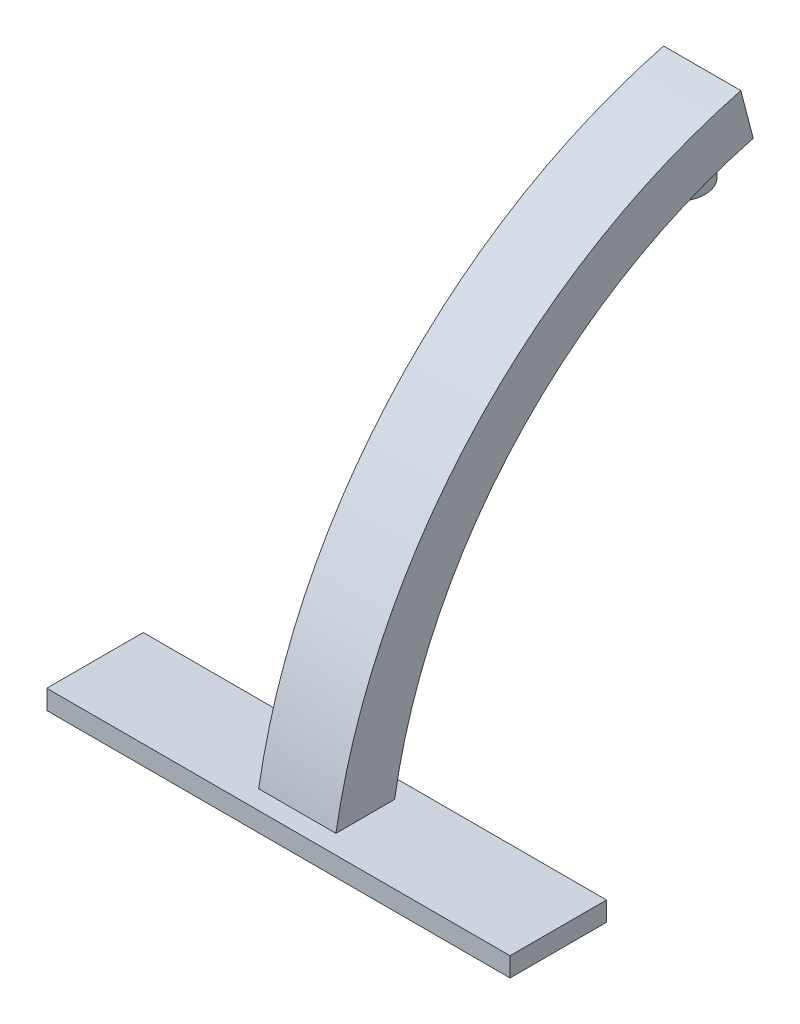
ISO-10303-21;
HEADER;
FILE_DESCRIPTION(('STEP AP214'),'2;1');
FILE_NAME('part.step','',(''),(''),'','','');
FILE_SCHEMA(('AUTOMOTIVE_DESIGN { 1 0 10303 214 1 1 1 1 }'));
ENDSEC;
DATA;
#1=APPLICATION_CONTEXT('core data for automotive mechanical design processes');
#2=APPLICATION_PROTOCOL_DEFINITION('international standard','automotive_design',2000,#1);
#3=PRODUCT_CONTEXT('',#1,'mechanical');
#4=PRODUCT('Part','Part','',(#3));
#5=PRODUCT_RELATED_PRODUCT_CATEGORY('part','',(#4));
#6=PRODUCT_DEFINITION_FORMATION('','',#4);
#7=PRODUCT_DEFINITION_CONTEXT('part definition',#1,'design');
#8=PRODUCT_DEFINITION('design','',#6,#7);
#9=PRODUCT_DEFINITION_SHAPE('','',#8);
#10=(LENGTH_UNIT() NAMED_UNIT(*) SI_UNIT(.MILLI.,.METRE.));
#11=(NAMED_UNIT(*) PLANE_ANGLE_UNIT() SI_UNIT($,.RADIAN.));
#12=(NAMED_UNIT(*) SI_UNIT($,.STERADIAN.) SOLID_ANGLE_UNIT());
#13=UNCERTAINTY_MEASURE_WITH_UNIT(LENGTH_MEASURE(1.E-05),#10,'distance_accuracy_value','');
#14=(GEOMETRIC_REPRESENTATION_CONTEXT(3) GLOBAL_UNCERTAINTY_ASSIGNED_CONTEXT((#13)) GLOBAL_UNIT_ASSIGNED_CONTEXT((#10,
#11,#12)) REPRESENTATION_CONTEXT('',''));
#15=CARTESIAN_POINT('',(0.,0.,0.));
#16=DIRECTION('',(0.,0.,1.));
#17=DIRECTION('',(1.,0.,0.));
#18=AXIS2_PLACEMENT_3D('',#15,#16,#17);
#19=CARTESIAN_POINT('',(63.5,-19.7348443641787,-184.022581395484));
#20=DIRECTION('',(1.,0.,0.));
#21=DIRECTION('',(0.,0.,-1.));
#22=AXIS2_PLACEMENT_3D('',#19,#20,#21);
#23=CYLINDRICAL_SURFACE('',#22,160.622919158415);
#24=DIRECTION('',(1.,0.,0.));
#25=VECTOR('',#24,1.);
#26=CARTESIAN_POINT('',(63.5,135.692592810273,-143.5005635243));
#27=LINE('',#26,#25);
#28=CARTESIAN_POINT('',(63.5,135.692592810273,-143.5005635243));
#29=VERTEX_POINT('',#28);
#30=CARTESIAN_POINT('',(88.9,135.692592810273,-143.5005635243));
#31=VERTEX_POINT('',#30);
#32=EDGE_CURVE('E182',#29,#31,#27,.T.);
#33=ORIENTED_EDGE('',*,*,#32,.T.);
#34=CARTESIAN_POINT('',(88.9,-19.7348443641787,-184.022581395484));
#35=DIRECTION('',(1.,0.,0.));
#36=DIRECTION('',(0.,0.,-1.));
#37=AXIS2_PLACEMENT_3D('',#34,#35,#36);
#38=CIRCLE('',#37,160.622919158415);
#39=CARTESIAN_POINT('',(88.9,6.35,-25.5318780294279));
#40=VERTEX_POINT('',#39);
#41=EDGE_CURVE('E161',#31,#40,#38,.T.);
#42=ORIENTED_EDGE('',*,*,#41,.T.);
#43=DIRECTION('',(1.,0.,0.));
#44=VECTOR('',#43,1.);
#45=CARTESIAN_POINT('',(63.5,6.35,-25.5318780294279));
#46=LINE('',#45,#44);
#47=CARTESIAN_POINT('',(63.5,6.35,-25.5318780294279));
#48=VERTEX_POINT('',#47);
#49=EDGE_CURVE('E179',#48,#40,#46,.T.);
#50=ORIENTED_EDGE('',*,*,#49,.F.);
#51=CARTESIAN_POINT('',(63.5,-19.7348443641787,-184.022581395484));
#52=DIRECTION('',(1.,0.,0.));
#53=DIRECTION('',(0.,0.,-1.));
#54=AXIS2_PLACEMENT_3D('',#51,#52,#53);
#55=CIRCLE('',#54,160.622919158415);
#56=EDGE_CURVE('E171',#29,#48,#55,.T.);
#57=ORIENTED_EDGE('',*,*,#56,.F.);
#58=EDGE_LOOP('',(#33,#42,#50,#57));
#59=FACE_BOUND('',#58,.T.);
#60=CARTESIAN_POINT('',(76.2,128.129005307118,-121.285));
#61=CARTESIAN_POINT('',(76.4526674331621,128.129004218327,-121.284997858437));
#62=CARTESIAN_POINT('',(76.7053066659111,128.13327527011,-121.295060972933));
#63=CARTESIAN_POINT('',(77.2087867459833,128.150298269242,-121.335204401861));
#64=CARTESIAN_POINT('',(77.4596270636416,128.163052618474,-121.365290385388));
#65=CARTESIAN_POINT('',(77.9578455859356,128.196884306877,-121.445207789697));
#66=CARTESIAN_POINT('',(78.205219729421,128.217970681064,-121.495060645332));
#67=CARTESIAN_POINT('',(78.694475981144,128.268176093866,-121.613990202545));
#68=CARTESIAN_POINT('',(78.9363578570135,128.297295471659,-121.683067715851));
#69=CARTESIAN_POINT('',(79.4123938383846,128.363100561254,-121.839560828303));
#70=CARTESIAN_POINT('',(79.6465650734362,128.399767974121,-121.926932085981));
#71=CARTESIAN_POINT('',(80.1062848459868,128.480249423183,-122.119277825864));
#72=CARTESIAN_POINT('',(80.3318332729169,128.52406355098,-122.224252533705));
#73=CARTESIAN_POINT('',(80.7728766294972,128.618300352775,-122.45082121919));
#74=CARTESIAN_POINT('',(80.9883747826617,128.668720887796,-122.572409818254));
#75=CARTESIAN_POINT('',(81.4082641051674,128.775635551108,-122.8312493196));
#76=CARTESIAN_POINT('',(81.6126512709096,128.832131847111,-122.96850581296));
#77=CARTESIAN_POINT('',(82.0162682936002,128.952711464573,-123.26273393123));
#78=CARTESIAN_POINT('',(82.2150527850469,129.016993775498,-123.420234835571));
#79=CARTESIAN_POINT('',(82.5985251649843,129.150777959365,-123.749658504238));
#80=CARTESIAN_POINT('',(82.7832078468659,129.220281741545,-123.921586546582));
#81=CARTESIAN_POINT('',(83.137523449482,129.363819945521,-124.278565271988));
#82=CARTESIAN_POINT('',(83.3071556649159,129.437854579368,-124.463616569306));
#83=CARTESIAN_POINT('',(83.6306072296066,129.589790510559,-124.84557720106));
#84=CARTESIAN_POINT('',(83.7844255845319,129.667692050587,-125.042487279909));
#85=CARTESIAN_POINT('',(84.0863766272739,129.832604506867,-125.461887737825));
#86=CARTESIAN_POINT('',(84.2332442647473,129.919862757542,-125.685192528003));
#87=CARTESIAN_POINT('',(84.5072227054554,130.097276786961,-126.142379826095));
#88=CARTESIAN_POINT('',(84.6343404626589,130.187431532291,-126.376258573282));
#89=CARTESIAN_POINT('',(84.8683663786006,130.369978572967,-126.853275484549));
#90=CARTESIAN_POINT('',(84.9752620126523,130.46237221529,-127.096419275724));
#91=CARTESIAN_POINT('',(85.1682103710966,130.648594728152,-127.59020580503));
#92=CARTESIAN_POINT('',(85.2542692918783,130.742423163168,-127.840846288835));
#93=CARTESIAN_POINT('',(85.4094726080765,130.936242904087,-128.362654872446));
#94=CARTESIAN_POINT('',(85.4773698734093,131.036280067563,-128.634177689258));
#95=CARTESIAN_POINT('',(85.5890242547924,131.23644394287,-129.182109617758));
#96=CARTESIAN_POINT('',(85.6327810012452,131.33657065605,-129.45851880419));
#97=CARTESIAN_POINT('',(85.6958351654858,131.53618691686,-130.014392465271));
#98=CARTESIAN_POINT('',(85.7151288436058,131.635676364758,-130.293857400466));
#99=CARTESIAN_POINT('',(85.7290163162777,131.833289363583,-130.853876647583));
#100=CARTESIAN_POINT('',(85.7236106777387,131.931412945807,-131.134430934355));
#101=CARTESIAN_POINT('',(85.6877064297387,132.127107364533,-131.698969329721));
#102=CARTESIAN_POINT('',(85.656824744036,132.22464671446,-131.982940152866));
#103=CARTESIAN_POINT('',(85.5694927339631,132.416907417102,-132.547776293219));
#104=CARTESIAN_POINT('',(85.513051756479,132.511629786489,-132.828642707263));
#105=CARTESIAN_POINT('',(85.3747455931772,132.697661800482,-133.385249886791));
#106=CARTESIAN_POINT('',(85.2928771088109,132.788971000598,-133.660989982351));
#107=CARTESIAN_POINT('',(85.1040398681648,132.967550529885,-134.205087132469));
#108=CARTESIAN_POINT('',(84.9970718864079,133.054820983585,-134.473444414562));
#109=CARTESIAN_POINT('',(84.7617173455658,133.222492418139,-134.993529219823));
#110=CARTESIAN_POINT('',(84.6339745089209,133.303014238044,-135.245509067221));
#111=CARTESIAN_POINT('',(84.3558626236141,133.45918740059,-135.738240391021));
#112=CARTESIAN_POINT('',(84.2054945885671,133.534838961203,-135.978992369801));
#113=CARTESIAN_POINT('',(83.8830349714884,133.680799709687,-136.447142010763));
#114=CARTESIAN_POINT('',(83.710947344429,133.751109866461,-136.674542093206));
#115=CARTESIAN_POINT('',(83.346126386386,133.885978372153,-137.113970126875));
#116=CARTESIAN_POINT('',(83.1533939135791,133.950536959951,-137.325998716458));
#117=CARTESIAN_POINT('',(82.7581435698814,134.070624880157,-137.723112811536));
#118=CARTESIAN_POINT('',(82.5565129813834,134.126436149543,-137.908996677753));
#119=CARTESIAN_POINT('',(82.1370592307786,134.232192467436,-138.263342730923));
#120=CARTESIAN_POINT('',(81.9192369087525,134.282137819939,-138.431805820641));
#121=CARTESIAN_POINT('',(81.4689686798928,134.375894542133,-138.749744164661));
#122=CARTESIAN_POINT('',(81.2365256046255,134.419707094278,-138.899223078757));
#123=CARTESIAN_POINT('',(80.7586883357763,134.500984429275,-139.177823115454));
#124=CARTESIAN_POINT('',(80.5132945417757,134.538449407824,-139.306944865666));
#125=CARTESIAN_POINT('',(80.0224704029672,134.605339223168,-139.538384647507));
#126=CARTESIAN_POINT('',(79.7775158370633,134.63504509392,-139.641631411694));
#127=CARTESIAN_POINT('',(79.279253463414,134.688348210856,-139.827456029434));
#128=CARTESIAN_POINT('',(79.0259461341545,134.711945806268,-139.910035064613));
#129=CARTESIAN_POINT('',(78.5128677431104,134.752925873254,-140.053767483815));
#130=CARTESIAN_POINT('',(78.2530975268503,134.770309153306,-140.114923654918));
#131=CARTESIAN_POINT('',(77.7290075523824,134.79878821032,-140.215261357567));
#132=CARTESIAN_POINT('',(77.4646878559017,134.80988407252,-140.254443187019));
#133=CARTESIAN_POINT('',(76.940825831002,134.825521655933,-140.309697561729));
#134=CARTESIAN_POINT('',(76.6813524490273,134.830235487706,-140.326376907956));
#135=CARTESIAN_POINT('',(76.1618744819274,134.833652692078,-140.338466223133));
#136=CARTESIAN_POINT('',(75.9018699084007,134.83235619454,-140.333876651626));
#137=CARTESIAN_POINT('',(75.3832235762999,134.823758528178,-140.303470257507));
#138=CARTESIAN_POINT('',(75.1245817270665,134.816457764014,-140.27765486542));
#139=CARTESIAN_POINT('',(74.6105041506608,134.795882118476,-140.205026087215));
#140=CARTESIAN_POINT('',(74.3550684267821,134.782607230964,-140.158212679528));
#141=CARTESIAN_POINT('',(73.8510922477064,134.750258133595,-140.044419408911));
#142=CARTESIAN_POINT('',(73.6025148641795,134.731227356458,-139.977590613454));
#143=CARTESIAN_POINT('',(73.1120429827557,134.687412413603,-139.824220284368));
#144=CARTESIAN_POINT('',(72.8701484264563,134.662628298182,-139.737678923072));
#145=CARTESIAN_POINT('',(72.3946855527883,134.607409990353,-139.545613687775));
#146=CARTESIAN_POINT('',(72.1611172831832,134.576975765539,-139.440089704902));
#147=CARTESIAN_POINT('',(71.7038577278601,134.510586195278,-139.210936348685));
#148=CARTESIAN_POINT('',(71.4801665598806,134.47463078404,-139.087306759592));
#149=CARTESIAN_POINT('',(71.0413566069085,134.396866698838,-138.821284516182));
#150=CARTESIAN_POINT('',(70.8263812669649,134.354990009965,-138.678675162992));
#151=CARTESIAN_POINT('',(70.4094081609178,134.265922361546,-138.377091818323));
#152=CARTESIAN_POINT('',(70.2074104526029,134.218731378338,-138.218117753983));
#153=CARTESIAN_POINT('',(69.8176133085327,134.119247412793,-137.885060871192));
#154=CARTESIAN_POINT('',(69.6298146808272,134.066954140478,-137.710977194083));
#155=CARTESIAN_POINT('',(69.2695089042764,133.957507545723,-137.349046479293));
#156=CARTESIAN_POINT('',(69.0970026336402,133.900353944532,-137.161198652294));
#157=CARTESIAN_POINT('',(68.7631767371143,133.779626961616,-136.767179676682));
#158=CARTESIAN_POINT('',(68.6023643394879,133.715910197487,-136.560622669442));
#159=CARTESIAN_POINT('',(68.2988744759841,133.583921695464,-136.135969845638));
#160=CARTESIAN_POINT('',(68.156197314107,133.515649881242,-135.917873835733));
#161=CARTESIAN_POINT('',(67.8896768558456,133.374891611282,-135.471725354533));
#162=CARTESIAN_POINT('',(67.7658359883727,133.302404613665,-135.243671604074));
#163=CARTESIAN_POINT('',(67.5375721854858,133.153597570854,-134.779247408436));
#164=CARTESIAN_POINT('',(67.4331499968886,133.077277378384,-134.542876643812));
#165=CARTESIAN_POINT('',(67.240003092932,132.917777028585,-134.052904760881));
#166=CARTESIAN_POINT('',(67.1521684378323,132.834442805783,-133.799002723352));
#167=CARTESIAN_POINT('',(66.9984622526262,132.664514314559,-133.285704021232));
#168=CARTESIAN_POINT('',(66.9325913028442,132.577919960066,-133.026307211651));
#169=CARTESIAN_POINT('',(66.8230095301855,132.401977411557,-132.503792493736));
#170=CARTESIAN_POINT('',(66.7792991185511,132.312629166468,-132.240674516441));
#171=CARTESIAN_POINT('',(66.7141039375747,132.131682011804,-131.712368992373));
#172=CARTESIAN_POINT('',(66.6926270708095,132.040082313819,-131.447180743473));
#173=CARTESIAN_POINT('',(66.6714308541936,131.851077784718,-130.904632248787));
#174=CARTESIAN_POINT('',(66.6727284391902,131.753596636041,-130.627258497568));
#175=CARTESIAN_POINT('',(66.699439722182,131.557446172585,-130.073983898106));
#176=CARTESIAN_POINT('',(66.7248626462797,131.458776417509,-129.798083653961));
#177=CARTESIAN_POINT('',(66.7995837087774,131.261001308332,-129.249762656209));
#178=CARTESIAN_POINT('',(66.8488766199743,131.161896054306,-128.977341154204));
#179=CARTESIAN_POINT('',(66.9710267206245,130.963910882723,-128.437601397186));
#180=CARTESIAN_POINT('',(67.043894836892,130.865031091107,-128.170285569553));
#181=CARTESIAN_POINT('',(67.2149608725505,130.66574767338,-127.635814243632));
#182=CARTESIAN_POINT('',(67.3137673281424,130.565371139477,-127.368843110781));
#183=CARTESIAN_POINT('',(67.5351273751016,130.36661280239,-126.844322013355));
#184=CARTESIAN_POINT('',(67.6576700481188,130.268230104963,-126.586767781635));
#185=CARTESIAN_POINT('',(67.9259368650511,130.07426473406,-126.08273370893));
#186=CARTESIAN_POINT('',(68.0716722883209,129.978683449921,-125.836259331608));
#187=CARTESIAN_POINT('',(68.3854291111326,129.791354664558,-125.356541416842));
#188=CARTESIAN_POINT('',(68.5534406695782,129.699605493794,-125.123292101452));
#189=CARTESIAN_POINT('',(68.9081087534556,129.522255502647,-124.675319904834));
#190=CARTESIAN_POINT('',(69.0944377284003,129.436581677131,-124.460366761557));
#191=CARTESIAN_POINT('',(69.4867077987136,129.270855460442,-124.046976715938));
#192=CARTESIAN_POINT('',(69.6926404254457,129.19080066762,-123.848532750553));
#193=CARTESIAN_POINT('',(70.1229819990445,129.037236284387,-123.469861009551));
#194=CARTESIAN_POINT('',(70.3473950533131,128.963728156615,-123.289637303447));
#195=CARTESIAN_POINT('',(70.8131656148004,128.824263909206,-122.949286547347));
#196=CARTESIAN_POINT('',(71.0545216264166,128.758307124341,-122.789157726988));
#197=CARTESIAN_POINT('',(71.5371720429383,128.638683642727,-122.499891825979));
#198=CARTESIAN_POINT('',(71.7775636638119,128.58451146292,-122.369456812594));
#199=CARTESIAN_POINT('',(72.2700663183568,128.484413371515,-122.129199341548));
#200=CARTESIAN_POINT('',(72.5221761046381,128.438486584722,-122.01937469617));
#201=CARTESIAN_POINT('',(73.0358184798867,128.355622991958,-121.821720328348));
#202=CARTESIAN_POINT('',(73.2973345574716,128.318671238669,-121.733854028593));
#203=CARTESIAN_POINT('',(73.8279835072439,128.25424850024,-121.580949154935));
#204=CARTESIAN_POINT('',(74.0971133396293,128.226773787602,-121.515901605818));
#205=CARTESIAN_POINT('',(74.6696688799031,128.179347172065,-121.40374850732));
#206=CARTESIAN_POINT('',(74.9737064992035,128.160501104622,-121.359274998896));
#207=CARTESIAN_POINT('',(75.5851767314968,128.135331035632,-121.29990252308));
#208=CARTESIAN_POINT('',(75.8926092350814,128.129006631721,-121.285002605388));
#209=CARTESIAN_POINT('',(76.2,128.129005307118,-121.285));
#210=B_SPLINE_CURVE_WITH_KNOTS('',3,(#60,#61,#62,#63,#64,#65,#66,#67,#68,#69,#70,#71,#72,#73,
#74,#75,#76,#77,#78,#79,#80,#81,#82,#83,#84,#85,#86,#87,#88,#89,#90,#91,#92,#93,#94,#95,#96,#97,
#98,#99,#100,#101,#102,#103,#104,#105,#106,#107,#108,#109,#110,#111,#112,#113,#114,#115,#116,
#117,#118,#119,#120,#121,#122,#123,#124,#125,#126,#127,#128,#129,#130,#131,#132,#133,#134,#135,
#136,#137,#138,#139,#140,#141,#142,#143,#144,#145,#146,#147,#148,#149,#150,#151,#152,#153,#154,
#155,#156,#157,#158,#159,#160,#161,#162,#163,#164,#165,#166,#167,#168,#169,#170,#171,#172,#173,
#174,#175,#176,#177,#178,#179,#180,#181,#182,#183,#184,#185,#186,#187,#188,#189,#190,#191,#192,
#193,#194,#195,#196,#197,#198,#199,#200,#201,#202,#203,#204,#205,#206,#207,#208,#209),
.UNSPECIFIED.,.T.,.F.,(4,2,2,2,2,2,2,2,2,2,2,2,2,2,2,2,2,2,2,2,2,2,2,2,2,2,2,2,2,2,2,2,2,2,2,2,
2,2,2,2,2,2,2,2,2,2,2,2,2,2,2,2,2,2,2,2,2,2,2,2,2,2,2,2,2,2,2,2,2,2,2,2,2,2,4),(0.,
0.757718209270425,1.51565104338194,2.27440802438234,3.03319704744273,3.7901677334245,
4.54714812267271,5.30388402513469,6.06089081752726,6.84495187725205,7.62930103870753,
8.41368693723562,9.19812212564094,10.0406606862492,10.8829019118878,11.7256630886786,
12.568173337807,13.4588137080603,14.3494677138669,15.2402578574914,16.1310275554306,
17.0354410093713,17.9395239912634,18.8437243031017,19.7478967166958,20.6280747906828,
21.5082134441977,22.3881920617634,23.2681341140635,24.1066677375738,24.945157885509,
25.7834861420805,26.6217885479806,27.423240997885,28.2246476162785,29.0259499341898,
29.8272413886034,30.6064618800024,31.3856655354004,32.1648166803134,32.9439686255772,
33.7173820338097,34.4907886808889,35.2641997638729,36.0376200636993,36.8207810943461,
37.6039456121076,38.3871546651684,39.1704086672318,39.9777521669239,40.7851091983088,
41.5925702490495,42.4000623472558,43.242993531109,44.0859469851065,44.9289160815693,
45.7721846958676,46.653199451956,47.5345512648408,48.4157101608681,49.2972780495666,
50.2017347919965,51.1057764799171,52.0102591825925,52.9143436283004,53.8044834525878,
54.6942404729647,55.5841957844568,56.4740726356311,57.3094115052578,58.1446616564388,
58.9785110665499,59.812032133128,60.7338884315469,61.6557151071318),.UNSPECIFIED.);
#211=CARTESIAN_POINT('',(76.2,128.129005307118,-121.285));
#212=VERTEX_POINT('',#211);
#213=EDGE_CURVE('E153',#212,#212,#210,.T.);
#214=ORIENTED_EDGE('',*,*,#213,.T.);
#215=EDGE_LOOP('',(#214));
#216=FACE_BOUND('',#215,.T.);
#217=DIRECTION('',(1.,0.,0.));
#218=VECTOR('',#217,1.);
#219=CARTESIAN_POINT('',(63.5,38.1,-34.1731471745239));
#220=LINE('',#219,#218);
#221=CARTESIAN_POINT('',(67.31,38.1,-34.1731471745239));
#222=VERTEX_POINT('',#221);
#223=CARTESIAN_POINT('',(85.09,38.1,-34.1731471745239));
#224=VERTEX_POINT('',#223);
#225=EDGE_CURVE('E12',#222,#224,#220,.T.);
#226=ORIENTED_EDGE('',*,*,#225,.F.);
#227=CARTESIAN_POINT('',(67.31,-19.7348443641787,-184.022581395484));
#228=DIRECTION('',(1.,0.,0.));
#229=DIRECTION('',(0.,0.,-1.));
#230=AXIS2_PLACEMENT_3D('',#227,#228,#229);
#231=CIRCLE('',#230,160.622919158415);
#232=CARTESIAN_POINT('',(67.31,12.7,-26.7085545890924));
#233=VERTEX_POINT('',#232);
#234=EDGE_CURVE('E47',#233,#222,#231,.F.);
#235=ORIENTED_EDGE('',*,*,#234,.F.);
#236=DIRECTION('',(1.,0.,0.));
#237=VECTOR('',#236,1.);
#238=CARTESIAN_POINT('',(63.5,12.7,-26.7085545890924));
#239=LINE('',#238,#237);
#240=CARTESIAN_POINT('',(85.09,12.7,-26.7085545890924));
#241=VERTEX_POINT('',#240);
#242=EDGE_CURVE('E411',#241,#233,#239,.F.);
#243=ORIENTED_EDGE('',*,*,#242,.F.);
#244=CARTESIAN_POINT('',(85.09,-19.7348443641787,-184.022581395484));
#245=DIRECTION('',(-1.,0.,0.));
#246=DIRECTION('',(0.,0.,1.));
#247=AXIS2_PLACEMENT_3D('',#244,#245,#246);
#248=CIRCLE('',#247,160.622919158415);
#249=EDGE_CURVE('E216',#224,#241,#248,.F.);
#250=ORIENTED_EDGE('',*,*,#249,.F.);
#251=EDGE_LOOP('',(#226,#235,#243,#250));
#252=FACE_BOUND('',#251,.T.);
#253=ADVANCED_FACE('F39',(#59,#216,#252),#23,.F.);
#254=CARTESIAN_POINT('',(0.,6.35,0.));
#255=DIRECTION('',(1.,0.,0.));
#256=DIRECTION('',(0.,0.,-1.));
#257=AXIS2_PLACEMENT_3D('',#254,#255,#256);
#258=PLANE('',#257);
#259=DIRECTION('',(0.,0.,1.));
#260=VECTOR('',#259,1.);
#261=CARTESIAN_POINT('',(0.,0.,0.));
#262=LINE('',#261,#260);
#263=CARTESIAN_POINT('',(0.,0.,-31.75));
#264=VERTEX_POINT('',#263);
#265=CARTESIAN_POINT('',(0.,0.,0.));
#266=VERTEX_POINT('',#265);
#267=EDGE_CURVE('E186',#264,#266,#262,.T.);
#268=ORIENTED_EDGE('',*,*,#267,.T.);
#269=DIRECTION('',(0.,-1.,0.));
#270=VECTOR('',#269,1.);
#271=CARTESIAN_POINT('',(0.,6.35,0.));
#272=LINE('',#271,#270);
#273=CARTESIAN_POINT('',(0.,6.35,0.));
#274=VERTEX_POINT('',#273);
#275=EDGE_CURVE('E213',#274,#266,#272,.T.);
#276=ORIENTED_EDGE('',*,*,#275,.F.);
#277=DIRECTION('',(0.,0.,1.));
#278=VECTOR('',#277,1.);
#279=CARTESIAN_POINT('',(0.,6.35,0.));
#280=LINE('',#279,#278);
#281=CARTESIAN_POINT('',(0.,6.35,-31.75));
#282=VERTEX_POINT('',#281);
#283=EDGE_CURVE('E187',#282,#274,#280,.T.);
#284=ORIENTED_EDGE('',*,*,#283,.F.);
#285=DIRECTION('',(0.,-1.,0.));
#286=VECTOR('',#285,1.);
#287=CARTESIAN_POINT('',(0.,6.35,-31.75));
#288=LINE('',#287,#286);
#289=EDGE_CURVE('E197',#282,#264,#288,.T.);
#290=ORIENTED_EDGE('',*,*,#289,.T.);
#291=EDGE_LOOP('',(#268,#276,#284,#290));
#292=FACE_BOUND('',#291,.T.);
#293=ADVANCED_FACE('F41',(#292),#258,.F.);
#294=CARTESIAN_POINT('',(0.,6.35,0.));
#295=DIRECTION('',(0.,0.,-1.));
#296=DIRECTION('',(-1.,0.,0.));
#297=AXIS2_PLACEMENT_3D('',#294,#295,#296);
#298=PLANE('',#297);
#299=DIRECTION('',(1.,0.,0.));
#300=VECTOR('',#299,1.);
#301=CARTESIAN_POINT('',(0.,0.,0.));
#302=LINE('',#301,#300);
#303=CARTESIAN_POINT('',(152.4,0.,0.));
#304=VERTEX_POINT('',#303);
#305=EDGE_CURVE('E200',#266,#304,#302,.T.);
#306=ORIENTED_EDGE('',*,*,#305,.T.);
#307=DIRECTION('',(0.,-1.,0.));
#308=VECTOR('',#307,1.);
#309=CARTESIAN_POINT('',(152.4,6.35,0.));
#310=LINE('',#309,#308);
#311=CARTESIAN_POINT('',(152.4,6.35,0.));
#312=VERTEX_POINT('',#311);
#313=EDGE_CURVE('E210',#312,#304,#310,.T.);
#314=ORIENTED_EDGE('',*,*,#313,.F.);
#315=DIRECTION('',(1.,0.,0.));
#316=VECTOR('',#315,1.);
#317=CARTESIAN_POINT('',(0.,6.35,0.));
#318=LINE('',#317,#316);
#319=EDGE_CURVE('E190',#274,#312,#318,.T.);
#320=ORIENTED_EDGE('',*,*,#319,.F.);
#321=ORIENTED_EDGE('',*,*,#275,.T.);
#322=EDGE_LOOP('',(#306,#314,#320,#321));
#323=FACE_BOUND('',#322,.T.);
#324=ADVANCED_FACE('F253',(#323),#298,.F.);
#325=CARTESIAN_POINT('',(152.4,6.35,0.));
#326=DIRECTION('',(-1.,0.,0.));
#327=DIRECTION('',(0.,0.,1.));
#328=AXIS2_PLACEMENT_3D('',#325,#326,#327);
#329=PLANE('',#328);
#330=DIRECTION('',(0.,0.,-1.));
#331=VECTOR('',#330,1.);
#332=CARTESIAN_POINT('',(152.4,0.,0.));
#333=LINE('',#332,#331);
#334=CARTESIAN_POINT('',(152.4,0.,-31.75));
#335=VERTEX_POINT('',#334);
#336=EDGE_CURVE('E202',#304,#335,#333,.T.);
#337=ORIENTED_EDGE('',*,*,#336,.T.);
#338=DIRECTION('',(0.,-1.,0.));
#339=VECTOR('',#338,1.);
#340=CARTESIAN_POINT('',(152.4,6.35,-31.75));
#341=LINE('',#340,#339);
#342=CARTESIAN_POINT('',(152.4,6.35,-31.75));
#343=VERTEX_POINT('',#342);
#344=EDGE_CURVE('E207',#343,#335,#341,.T.);
#345=ORIENTED_EDGE('',*,*,#344,.F.);
#346=DIRECTION('',(0.,0.,-1.));
#347=VECTOR('',#346,1.);
#348=CARTESIAN_POINT('',(152.4,6.35,0.));
#349=LINE('',#348,#347);
#350=EDGE_CURVE('E193',#312,#343,#349,.T.);
#351=ORIENTED_EDGE('',*,*,#350,.F.);
#352=ORIENTED_EDGE('',*,*,#313,.T.);
#353=EDGE_LOOP('',(#337,#345,#351,#352));
#354=FACE_BOUND('',#353,.T.);
#355=ADVANCED_FACE('F286',(#354),#329,.F.);
#356=CARTESIAN_POINT('',(0.,6.35,-31.75));
#357=DIRECTION('',(0.,0.,1.));
#358=DIRECTION('',(1.,0.,0.));
#359=AXIS2_PLACEMENT_3D('',#356,#357,#358);
#360=PLANE('',#359);
#361=DIRECTION('',(-1.,0.,0.));
#362=VECTOR('',#361,1.);
#363=CARTESIAN_POINT('',(0.,0.,-31.75));
#364=LINE('',#363,#362);
#365=EDGE_CURVE('E191',#335,#264,#364,.T.);
#366=ORIENTED_EDGE('',*,*,#365,.T.);
#367=ORIENTED_EDGE('',*,*,#289,.F.);
#368=DIRECTION('',(-1.,0.,0.));
#369=VECTOR('',#368,1.);
#370=CARTESIAN_POINT('',(0.,6.35,-31.75));
#371=LINE('',#370,#369);
#372=EDGE_CURVE('E195',#343,#282,#371,.T.);
#373=ORIENTED_EDGE('',*,*,#372,.F.);
#374=ORIENTED_EDGE('',*,*,#344,.T.);
#375=EDGE_LOOP('',(#366,#367,#373,#374));
#376=FACE_BOUND('',#375,.T.);
#377=ADVANCED_FACE('F273',(#376),#360,.F.);
#378=CARTESIAN_POINT('',(0.,6.35,0.));
#379=DIRECTION('',(0.,-1.,0.));
#380=DIRECTION('',(0.,0.,-1.));
#381=AXIS2_PLACEMENT_3D('',#378,#379,#380);
#382=PLANE('',#381);
#383=DIRECTION('',(0.,0.,-1.));
#384=VECTOR('',#383,1.);
#385=CARTESIAN_POINT('',(63.5,6.35,-6.21812197057206));
#386=LINE('',#385,#384);
#387=CARTESIAN_POINT('',(63.5,6.35,-6.21812197057206));
#388=VERTEX_POINT('',#387);
#389=EDGE_CURVE('E174',#388,#48,#386,.T.);
#390=ORIENTED_EDGE('',*,*,#389,.T.);
#391=ORIENTED_EDGE('',*,*,#49,.T.);
#392=DIRECTION('',(0.,0.,-1.));
#393=VECTOR('',#392,1.);
#394=CARTESIAN_POINT('',(88.9,6.35,-6.21812197057206));
#395=LINE('',#394,#393);
#396=CARTESIAN_POINT('',(88.9,6.35,-6.21812197057206));
#397=VERTEX_POINT('',#396);
#398=EDGE_CURVE('E164',#397,#40,#395,.T.);
#399=ORIENTED_EDGE('',*,*,#398,.F.);
#400=DIRECTION('',(1.,0.,0.));
#401=VECTOR('',#400,1.);
#402=CARTESIAN_POINT('',(63.5,6.35,-6.21812197057206));
#403=LINE('',#402,#401);
#404=EDGE_CURVE('E177',#388,#397,#403,.T.);
#405=ORIENTED_EDGE('',*,*,#404,.F.);
#406=EDGE_LOOP('',(#390,#391,#399,#405));
#407=FACE_BOUND('',#406,.T.);
#408=ORIENTED_EDGE('',*,*,#283,.T.);
#409=ORIENTED_EDGE('',*,*,#319,.T.);
#410=ORIENTED_EDGE('',*,*,#350,.T.);
#411=ORIENTED_EDGE('',*,*,#372,.T.);
#412=EDGE_LOOP('',(#408,#409,#410,#411));
#413=FACE_BOUND('',#412,.T.);
#414=ADVANCED_FACE('F269',(#407,#413),#382,.F.);
#415=CARTESIAN_POINT('',(0.,0.,0.));
#416=DIRECTION('',(0.,-1.,0.));
#417=DIRECTION('',(0.,0.,-1.));
#418=AXIS2_PLACEMENT_3D('',#415,#416,#417);
#419=PLANE('',#418);
#420=ORIENTED_EDGE('',*,*,#267,.F.);
#421=ORIENTED_EDGE('',*,*,#365,.F.);
#422=ORIENTED_EDGE('',*,*,#336,.F.);
#423=ORIENTED_EDGE('',*,*,#305,.F.);
#424=EDGE_LOOP('',(#420,#421,#422,#423));
#425=FACE_BOUND('',#424,.T.);
#426=ADVANCED_FACE('F272',(#425),#419,.T.);
#427=CARTESIAN_POINT('',(63.5,-24.4290806719762,-185.246431772317));
#428=DIRECTION('',(1.,0.,0.));
#429=DIRECTION('',(0.,0.,-1.));
#430=AXIS2_PLACEMENT_3D('',#427,#428,#429);
#431=CYLINDRICAL_SURFACE('',#430,181.654858227028);
#432=ORIENTED_EDGE('',*,*,#404,.T.);
#433=CARTESIAN_POINT('',(88.9,-24.4290806719762,-185.246431772317));
#434=DIRECTION('',(-1.,0.,0.));
#435=DIRECTION('',(0.,0.,1.));
#436=AXIS2_PLACEMENT_3D('',#433,#434,#435);
#437=CIRCLE('',#436,181.654858227028);
#438=CARTESIAN_POINT('',(88.9,151.35,-139.418467431791));
#439=VERTEX_POINT('',#438);
#440=EDGE_CURVE('E155',#397,#439,#437,.T.);
#441=ORIENTED_EDGE('',*,*,#440,.T.);
#442=DIRECTION('',(1.,0.,0.));
#443=VECTOR('',#442,1.);
#444=CARTESIAN_POINT('',(63.5,151.35,-139.418467431791));
#445=LINE('',#444,#443);
#446=CARTESIAN_POINT('',(63.5,151.35,-139.418467431791));
#447=VERTEX_POINT('',#446);
#448=EDGE_CURVE('E184',#447,#439,#445,.T.);
#449=ORIENTED_EDGE('',*,*,#448,.F.);
#450=CARTESIAN_POINT('',(63.5,-24.4290806719762,-185.246431772317));
#451=DIRECTION('',(-1.,0.,0.));
#452=DIRECTION('',(0.,0.,1.));
#453=AXIS2_PLACEMENT_3D('',#450,#451,#452);
#454=CIRCLE('',#453,181.654858227028);
#455=EDGE_CURVE('E166',#388,#447,#454,.T.);
#456=ORIENTED_EDGE('',*,*,#455,.F.);
#457=EDGE_LOOP('',(#432,#441,#449,#456));
#458=FACE_BOUND('',#457,.T.);
#459=ADVANCED_FACE('F246',(#458),#431,.T.);
#460=CARTESIAN_POINT('',(63.5,151.35,-139.418467431791));
#461=DIRECTION('',(0.,-0.252280422267884,0.967654167841145));
#462=DIRECTION('',(0.,-0.967654167841145,-0.252280422267884));
#463=AXIS2_PLACEMENT_3D('',#460,#461,#462);
#464=PLANE('',#463);
#465=ORIENTED_EDGE('',*,*,#448,.T.);
#466=DIRECTION('',(0.,-0.967654167841145,-0.252280422267884));
#467=VECTOR('',#466,1.);
#468=CARTESIAN_POINT('',(88.9,151.35,-139.418467431791));
#469=LINE('',#468,#467);
#470=EDGE_CURVE('E158',#439,#31,#469,.T.);
#471=ORIENTED_EDGE('',*,*,#470,.T.);
#472=ORIENTED_EDGE('',*,*,#32,.F.);
#473=DIRECTION('',(0.,-0.967654167841145,-0.252280422267884));
#474=VECTOR('',#473,1.);
#475=CARTESIAN_POINT('',(63.5,151.35,-139.418467431791));
#476=LINE('',#475,#474);
#477=EDGE_CURVE('E169',#447,#29,#476,.T.);
#478=ORIENTED_EDGE('',*,*,#477,.F.);
#479=EDGE_LOOP('',(#465,#471,#472,#478));
#480=FACE_BOUND('',#479,.T.);
#481=ADVANCED_FACE('F241',(#480),#464,.F.);
#482=CARTESIAN_POINT('',(63.5,-24.4290806719762,-185.246431772317));
#483=DIRECTION('',(-1.,0.,0.));
#484=DIRECTION('',(0.,0.,1.));
#485=AXIS2_PLACEMENT_3D('',#482,#483,#484);
#486=PLANE('',#485);
#487=ORIENTED_EDGE('',*,*,#455,.T.);
#488=ORIENTED_EDGE('',*,*,#477,.T.);
#489=ORIENTED_EDGE('',*,*,#56,.T.);
#490=ORIENTED_EDGE('',*,*,#389,.F.);
#491=EDGE_LOOP('',(#487,#488,#489,#490));
#492=FACE_BOUND('',#491,.T.);
#493=ADVANCED_FACE('F238',(#492),#486,.T.);
#494=CARTESIAN_POINT('',(88.9,-24.4290806719762,-185.246431772317));
#495=DIRECTION('',(-1.,0.,0.));
#496=DIRECTION('',(0.,0.,1.));
#497=AXIS2_PLACEMENT_3D('',#494,#495,#496);
#498=PLANE('',#497);
#499=ORIENTED_EDGE('',*,*,#440,.F.);
#500=ORIENTED_EDGE('',*,*,#398,.T.);
#501=ORIENTED_EDGE('',*,*,#41,.F.);
#502=ORIENTED_EDGE('',*,*,#470,.F.);
#503=EDGE_LOOP('',(#499,#500,#501,#502));
#504=FACE_BOUND('',#503,.T.);
#505=ADVANCED_FACE('F234',(#504),#498,.F.);
#506=CARTESIAN_POINT('',(76.2,124.46,-130.81));
#507=DIRECTION('',(0.,1.,0.));
#508=DIRECTION('',(0.,0.,1.));
#509=AXIS2_PLACEMENT_3D('',#506,#507,#508);
#510=CYLINDRICAL_SURFACE('',#509,9.52500000000002);
#511=CARTESIAN_POINT('',(76.2,124.46,-130.81));
#512=DIRECTION('',(0.,1.,0.));
#513=DIRECTION('',(0.,0.,1.));
#514=AXIS2_PLACEMENT_3D('',#511,#512,#513);
#515=CIRCLE('',#514,9.52500000000002);
#516=CARTESIAN_POINT('',(76.2,124.46,-121.285));
#517=VERTEX_POINT('',#516);
#518=EDGE_CURVE('E150',#517,#517,#515,.T.);
#519=ORIENTED_EDGE('',*,*,#518,.T.);
#520=EDGE_LOOP('',(#519));
#521=FACE_BOUND('',#520,.T.);
#522=ORIENTED_EDGE('',*,*,#213,.F.);
#523=EDGE_LOOP('',(#522));
#524=FACE_BOUND('',#523,.T.);
#525=ADVANCED_FACE('F228',(#521,#524),#510,.T.);
#526=CARTESIAN_POINT('',(76.2,124.46,-130.81));
#527=DIRECTION('',(0.,1.,0.));
#528=DIRECTION('',(0.,0.,1.));
#529=AXIS2_PLACEMENT_3D('',#526,#527,#528);
#530=PLANE('',#529);
#531=ORIENTED_EDGE('',*,*,#518,.F.);
#532=EDGE_LOOP('',(#531));
#533=FACE_BOUND('',#532,.T.);
#534=ADVANCED_FACE('F233',(#533),#530,.F.);
#535=CARTESIAN_POINT('',(85.09,38.1,-146.0415635243));
#536=DIRECTION('',(0.,-1.,0.));
#537=DIRECTION('',(0.,0.,-1.));
#538=AXIS2_PLACEMENT_3D('',#535,#536,#537);
#539=PLANE('',#538);
#540=DIRECTION('',(0.,0.,1.));
#541=VECTOR('',#540,1.);
#542=CARTESIAN_POINT('',(67.31,38.1,-146.0415635243));
#543=LINE('',#542,#541);
#544=CARTESIAN_POINT('',(67.31,38.1,-35.535263345492));
#545=VERTEX_POINT('',#544);
#546=EDGE_CURVE('E135',#545,#222,#543,.T.);
#547=ORIENTED_EDGE('',*,*,#546,.T.);
#548=ORIENTED_EDGE('',*,*,#225,.T.);
#549=DIRECTION('',(0.,0.,1.));
#550=VECTOR('',#549,1.);
#551=CARTESIAN_POINT('',(85.09,38.1,-146.0415635243));
#552=LINE('',#551,#550);
#553=CARTESIAN_POINT('',(85.09,38.1,-35.535263345492));
#554=VERTEX_POINT('',#553);
#555=EDGE_CURVE('E139',#554,#224,#552,.T.);
#556=ORIENTED_EDGE('',*,*,#555,.F.);
#557=DIRECTION('',(1.,0.,0.));
#558=VECTOR('',#557,1.);
#559=CARTESIAN_POINT('',(63.5,38.1,-35.535263345492));
#560=LINE('',#559,#558);
#561=EDGE_CURVE('E126',#554,#545,#560,.F.);
#562=ORIENTED_EDGE('',*,*,#561,.T.);
#563=EDGE_LOOP('',(#547,#548,#556,#562));
#564=FACE_BOUND('',#563,.T.);
#565=ADVANCED_FACE('F142',(#564),#539,.F.);
#566=CARTESIAN_POINT('',(67.31,38.1,-146.0415635243));
#567=DIRECTION('',(1.,0.,0.));
#568=DIRECTION('',(0.,0.,-1.));
#569=AXIS2_PLACEMENT_3D('',#566,#567,#568);
#570=PLANE('',#569);
#571=DIRECTION('',(0.,0.,1.));
#572=VECTOR('',#571,1.);
#573=CARTESIAN_POINT('',(67.31,12.7,-146.0415635243));
#574=LINE('',#573,#572);
#575=CARTESIAN_POINT('',(67.31,12.7,-28.0054870904697));
#576=VERTEX_POINT('',#575);
#577=EDGE_CURVE('E138',#576,#233,#574,.T.);
#578=ORIENTED_EDGE('',*,*,#577,.T.);
#579=ORIENTED_EDGE('',*,*,#234,.T.);
#580=ORIENTED_EDGE('',*,*,#546,.F.);
#581=CARTESIAN_POINT('',(67.31,-19.7348443641787,-184.022581395484));
#582=DIRECTION('',(1.,0.,0.));
#583=DIRECTION('',(0.,0.,-1.));
#584=AXIS2_PLACEMENT_3D('',#581,#582,#583);
#585=CIRCLE('',#584,159.352919158415);
#586=EDGE_CURVE('E122',#545,#576,#585,.T.);
#587=ORIENTED_EDGE('',*,*,#586,.T.);
#588=EDGE_LOOP('',(#578,#579,#580,#587));
#589=FACE_BOUND('',#588,.T.);
#590=ADVANCED_FACE('F136',(#589),#570,.F.);
#591=CARTESIAN_POINT('',(85.09,12.7,-146.0415635243));
#592=DIRECTION('',(0.,1.,0.));
#593=DIRECTION('',(0.,0.,1.));
#594=AXIS2_PLACEMENT_3D('',#591,#592,#593);
#595=PLANE('',#594);
#596=DIRECTION('',(0.,0.,1.));
#597=VECTOR('',#596,1.);
#598=CARTESIAN_POINT('',(85.09,12.7,-146.0415635243));
#599=LINE('',#598,#597);
#600=CARTESIAN_POINT('',(85.09,12.7,-28.0054870904697));
#601=VERTEX_POINT('',#600);
#602=EDGE_CURVE('E144',#601,#241,#599,.T.);
#603=ORIENTED_EDGE('',*,*,#602,.T.);
#604=ORIENTED_EDGE('',*,*,#242,.T.);
#605=ORIENTED_EDGE('',*,*,#577,.F.);
#606=DIRECTION('',(1.,0.,0.));
#607=VECTOR('',#606,1.);
#608=CARTESIAN_POINT('',(63.5,12.7,-28.0054870904697));
#609=LINE('',#608,#607);
#610=EDGE_CURVE('E129',#576,#601,#609,.T.);
#611=ORIENTED_EDGE('',*,*,#610,.T.);
#612=EDGE_LOOP('',(#603,#604,#605,#611));
#613=FACE_BOUND('',#612,.T.);
#614=ADVANCED_FACE('F376',(#613),#595,.F.);
#615=CARTESIAN_POINT('',(85.09,38.1,-146.0415635243));
#616=DIRECTION('',(-1.,0.,0.));
#617=DIRECTION('',(0.,0.,1.));
#618=AXIS2_PLACEMENT_3D('',#615,#616,#617);
#619=PLANE('',#618);
#620=ORIENTED_EDGE('',*,*,#555,.T.);
#621=ORIENTED_EDGE('',*,*,#249,.T.);
#622=ORIENTED_EDGE('',*,*,#602,.F.);
#623=CARTESIAN_POINT('',(85.09,-19.7348443641787,-184.022581395484));
#624=DIRECTION('',(-1.,0.,0.));
#625=DIRECTION('',(0.,0.,1.));
#626=AXIS2_PLACEMENT_3D('',#623,#624,#625);
#627=CIRCLE('',#626,159.352919158415);
#628=EDGE_CURVE('E154',#601,#554,#627,.T.);
#629=ORIENTED_EDGE('',*,*,#628,.T.);
#630=EDGE_LOOP('',(#620,#621,#622,#629));
#631=FACE_BOUND('',#630,.T.);
#632=ADVANCED_FACE('F385',(#631),#619,.F.);
#633=CARTESIAN_POINT('',(63.5,-19.7348443641787,-184.022581395484));
#634=DIRECTION('',(1.,0.,0.));
#635=DIRECTION('',(0.,0.,-1.));
#636=AXIS2_PLACEMENT_3D('',#633,#634,#635);
#637=CYLINDRICAL_SURFACE('',#636,159.352919158415);
#638=ORIENTED_EDGE('',*,*,#610,.F.);
#639=ORIENTED_EDGE('',*,*,#586,.F.);
#640=ORIENTED_EDGE('',*,*,#561,.F.);
#641=ORIENTED_EDGE('',*,*,#628,.F.);
#642=EDGE_LOOP('',(#638,#639,#640,#641));
#643=FACE_BOUND('',#642,.T.);
#644=ADVANCED_FACE('F124',(#643),#637,.F.);
#645=CLOSED_SHELL('',(#253,#293,#324,#355,#377,#414,#426,#459,#481,#493,#505,#525,#534,#565,
#590,#614,#632,#644));
#646=MANIFOLD_SOLID_BREP('B2',#645);
#647=ADVANCED_BREP_SHAPE_REPRESENTATION('',(#18,#646),#14);
#648=SHAPE_DEFINITION_REPRESENTATION(#9,#647);
ENDSEC;
END-ISO-10303-21;
